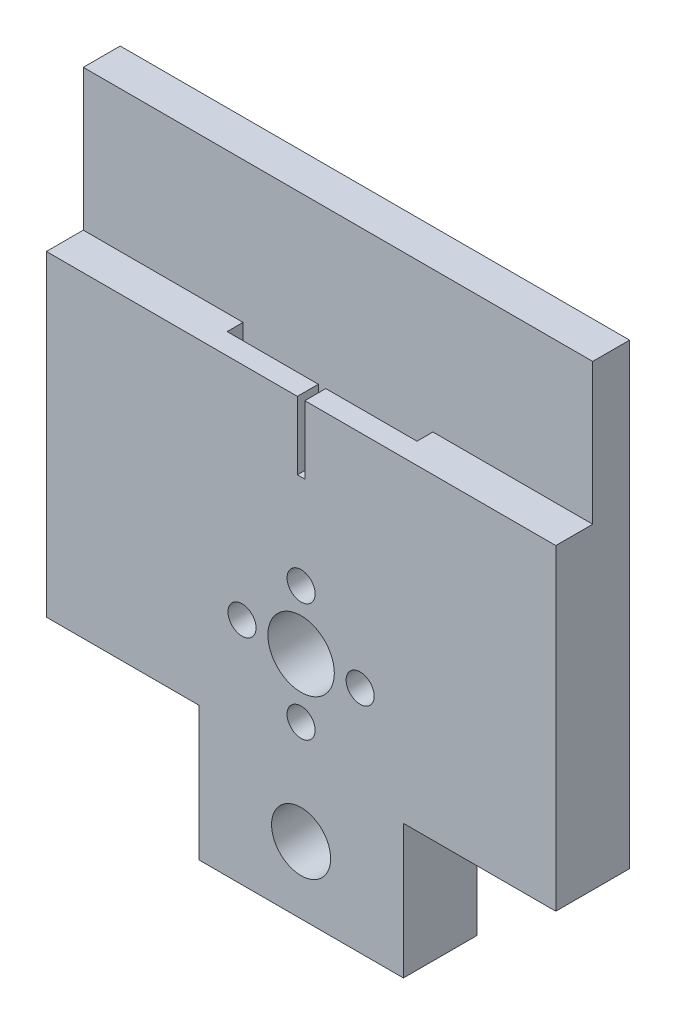
ISO-10303-21;
HEADER;
FILE_DESCRIPTION(('STEP AP214'),'2;1');
FILE_NAME('part.step','',(''),(''),'','','');
FILE_SCHEMA(('AUTOMOTIVE_DESIGN { 1 0 10303 214 1 1 1 1 }'));
ENDSEC;
DATA;
#1=APPLICATION_CONTEXT('core data for automotive mechanical design processes');
#2=APPLICATION_PROTOCOL_DEFINITION('international standard','automotive_design',2000,#1);
#3=PRODUCT_CONTEXT('',#1,'mechanical');
#4=PRODUCT('Part','Part','',(#3));
#5=PRODUCT_RELATED_PRODUCT_CATEGORY('part','',(#4));
#6=PRODUCT_DEFINITION_FORMATION('','',#4);
#7=PRODUCT_DEFINITION_CONTEXT('part definition',#1,'design');
#8=PRODUCT_DEFINITION('design','',#6,#7);
#9=PRODUCT_DEFINITION_SHAPE('','',#8);
#10=(LENGTH_UNIT() NAMED_UNIT(*) SI_UNIT(.MILLI.,.METRE.));
#11=(NAMED_UNIT(*) PLANE_ANGLE_UNIT() SI_UNIT($,.RADIAN.));
#12=(NAMED_UNIT(*) SI_UNIT($,.STERADIAN.) SOLID_ANGLE_UNIT());
#13=UNCERTAINTY_MEASURE_WITH_UNIT(LENGTH_MEASURE(1.E-05),#10,'distance_accuracy_value','');
#14=(GEOMETRIC_REPRESENTATION_CONTEXT(3) GLOBAL_UNCERTAINTY_ASSIGNED_CONTEXT((#13)) GLOBAL_UNIT_ASSIGNED_CONTEXT((#10,
#11,#12)) REPRESENTATION_CONTEXT('',''));
#15=CARTESIAN_POINT('',(0.,0.,0.));
#16=DIRECTION('',(0.,0.,1.));
#17=DIRECTION('',(1.,0.,0.));
#18=AXIS2_PLACEMENT_3D('',#15,#16,#17);
#19=CARTESIAN_POINT('',(-253.536671068928,20.97390674954,5.));
#20=DIRECTION('',(0.,1.,0.));
#21=DIRECTION('',(-1.,0.,0.));
#22=AXIS2_PLACEMENT_3D('',#19,#20,#21);
#23=PLANE('',#22);
#24=DIRECTION('',(0.,0.,-1.));
#25=VECTOR('',#24,1.);
#26=CARTESIAN_POINT('',(12.858,20.97390674954,5.));
#27=LINE('',#26,#25);
#28=CARTESIAN_POINT('',(12.858,20.97390674954,7.159));
#29=VERTEX_POINT('',#28);
#30=CARTESIAN_POINT('',(12.858,20.97390674954,5.));
#31=VERTEX_POINT('',#30);
#32=EDGE_CURVE('E219',#29,#31,#27,.T.);
#33=ORIENTED_EDGE('',*,*,#32,.F.);
#34=DIRECTION('',(1.,0.,0.));
#35=VECTOR('',#34,1.);
#36=CARTESIAN_POINT('',(12.858,20.97390674954,7.159));
#37=LINE('',#36,#35);
#38=CARTESIAN_POINT('',(0.507999999999997,20.97390674954,7.159));
#39=VERTEX_POINT('',#38);
#40=EDGE_CURVE('E223',#39,#29,#37,.T.);
#41=ORIENTED_EDGE('',*,*,#40,.F.);
#42=DIRECTION('',(0.,0.,1.));
#43=VECTOR('',#42,1.);
#44=CARTESIAN_POINT('',(0.508,20.97390674954,5.));
#45=LINE('',#44,#43);
#46=CARTESIAN_POINT('',(0.508,20.97390674954,10.));
#47=VERTEX_POINT('',#46);
#48=EDGE_CURVE('E291',#39,#47,#45,.T.);
#49=ORIENTED_EDGE('',*,*,#48,.T.);
#50=DIRECTION('',(1.,0.,0.));
#51=VECTOR('',#50,1.);
#52=CARTESIAN_POINT('',(-253.536671068928,20.97390674954,10.));
#53=LINE('',#52,#51);
#54=CARTESIAN_POINT('',(34.5,20.97390674954,10.));
#55=VERTEX_POINT('',#54);
#56=EDGE_CURVE('E310',#47,#55,#53,.T.);
#57=ORIENTED_EDGE('',*,*,#56,.T.);
#58=DIRECTION('',(0.,0.,-1.));
#59=VECTOR('',#58,1.);
#60=CARTESIAN_POINT('',(34.5,20.97390674954,10.));
#61=LINE('',#60,#59);
#62=CARTESIAN_POINT('',(34.5,20.97390674954,5.));
#63=VERTEX_POINT('',#62);
#64=EDGE_CURVE('E317',#55,#63,#61,.T.);
#65=ORIENTED_EDGE('',*,*,#64,.T.);
#66=DIRECTION('',(1.,0.,0.));
#67=VECTOR('',#66,1.);
#68=CARTESIAN_POINT('',(-253.536671068928,20.97390674954,5.));
#69=LINE('',#68,#67);
#70=EDGE_CURVE('E70',#31,#63,#69,.T.);
#71=ORIENTED_EDGE('',*,*,#70,.F.);
#72=EDGE_LOOP('',(#33,#41,#49,#57,#65,#71));
#73=FACE_BOUND('',#72,.T.);
#74=ADVANCED_FACE('F47',(#73),#23,.T.);
#75=CARTESIAN_POINT('',(34.5,40.07390674954,10.));
#76=DIRECTION('',(-1.,0.,0.));
#77=DIRECTION('',(0.,-1.,0.));
#78=AXIS2_PLACEMENT_3D('',#75,#76,#77);
#79=PLANE('',#78);
#80=DIRECTION('',(0.,1.,0.));
#81=VECTOR('',#80,1.);
#82=CARTESIAN_POINT('',(34.5,40.07390674954,5.));
#83=LINE('',#82,#81);
#84=CARTESIAN_POINT('',(34.5,40.07390674954,5.));
#85=VERTEX_POINT('',#84);
#86=EDGE_CURVE('E321',#63,#85,#83,.T.);
#87=ORIENTED_EDGE('',*,*,#86,.F.);
#88=ORIENTED_EDGE('',*,*,#64,.F.);
#89=DIRECTION('',(0.,1.,0.));
#90=VECTOR('',#89,1.);
#91=CARTESIAN_POINT('',(34.5,40.07390674954,10.));
#92=LINE('',#91,#90);
#93=CARTESIAN_POINT('',(34.5,-21.92609325046,10.));
#94=VERTEX_POINT('',#93);
#95=EDGE_CURVE('E377',#94,#55,#92,.T.);
#96=ORIENTED_EDGE('',*,*,#95,.F.);
#97=DIRECTION('',(0.,0.,-1.));
#98=VECTOR('',#97,1.);
#99=CARTESIAN_POINT('',(34.5,-21.92609325046,10.));
#100=LINE('',#99,#98);
#101=CARTESIAN_POINT('',(34.5,-21.92609325046,0.));
#102=VERTEX_POINT('',#101);
#103=EDGE_CURVE('E448',#94,#102,#100,.T.);
#104=ORIENTED_EDGE('',*,*,#103,.T.);
#105=DIRECTION('',(0.,1.,0.));
#106=VECTOR('',#105,1.);
#107=CARTESIAN_POINT('',(34.5,40.07390674954,0.));
#108=LINE('',#107,#106);
#109=CARTESIAN_POINT('',(34.5,40.07390674954,0.));
#110=VERTEX_POINT('',#109);
#111=EDGE_CURVE('E401',#102,#110,#108,.T.);
#112=ORIENTED_EDGE('',*,*,#111,.T.);
#113=DIRECTION('',(0.,0.,-1.));
#114=VECTOR('',#113,1.);
#115=CARTESIAN_POINT('',(34.5,40.07390674954,10.));
#116=LINE('',#115,#114);
#117=EDGE_CURVE('E445',#85,#110,#116,.T.);
#118=ORIENTED_EDGE('',*,*,#117,.F.);
#119=EDGE_LOOP('',(#87,#88,#96,#104,#112,#118));
#120=FACE_BOUND('',#119,.T.);
#121=ADVANCED_FACE('F498',(#120),#79,.F.);
#122=CARTESIAN_POINT('',(-34.5,40.07390674954,10.));
#123=DIRECTION('',(1.,0.,0.));
#124=DIRECTION('',(0.,1.,0.));
#125=AXIS2_PLACEMENT_3D('',#122,#123,#124);
#126=PLANE('',#125);
#127=DIRECTION('',(0.,-1.,0.));
#128=VECTOR('',#127,1.);
#129=CARTESIAN_POINT('',(-34.5,40.07390674954,5.));
#130=LINE('',#129,#128);
#131=CARTESIAN_POINT('',(-34.5,40.07390674954,5.));
#132=VERTEX_POINT('',#131);
#133=CARTESIAN_POINT('',(-34.5,20.97390674954,5.));
#134=VERTEX_POINT('',#133);
#135=EDGE_CURVE('E56',#132,#134,#130,.T.);
#136=ORIENTED_EDGE('',*,*,#135,.F.);
#137=DIRECTION('',(0.,0.,-1.));
#138=VECTOR('',#137,1.);
#139=CARTESIAN_POINT('',(-34.5,40.07390674954,10.));
#140=LINE('',#139,#138);
#141=CARTESIAN_POINT('',(-34.5,40.07390674954,0.));
#142=VERTEX_POINT('',#141);
#143=EDGE_CURVE('E442',#132,#142,#140,.T.);
#144=ORIENTED_EDGE('',*,*,#143,.T.);
#145=DIRECTION('',(0.,-1.,0.));
#146=VECTOR('',#145,1.);
#147=CARTESIAN_POINT('',(-34.5,40.07390674954,0.));
#148=LINE('',#147,#146);
#149=CARTESIAN_POINT('',(-34.5,-21.92609325046,0.));
#150=VERTEX_POINT('',#149);
#151=EDGE_CURVE('E409',#142,#150,#148,.T.);
#152=ORIENTED_EDGE('',*,*,#151,.T.);
#153=DIRECTION('',(0.,0.,-1.));
#154=VECTOR('',#153,1.);
#155=CARTESIAN_POINT('',(-34.5,-21.92609325046,10.));
#156=LINE('',#155,#154);
#157=CARTESIAN_POINT('',(-34.5,-21.92609325046,10.));
#158=VERTEX_POINT('',#157);
#159=EDGE_CURVE('E438',#158,#150,#156,.T.);
#160=ORIENTED_EDGE('',*,*,#159,.F.);
#161=DIRECTION('',(0.,-1.,0.));
#162=VECTOR('',#161,1.);
#163=CARTESIAN_POINT('',(-34.5,40.07390674954,10.));
#164=LINE('',#163,#162);
#165=CARTESIAN_POINT('',(-34.5000000000001,20.97390674954,10.));
#166=VERTEX_POINT('',#165);
#167=EDGE_CURVE('E382',#166,#158,#164,.T.);
#168=ORIENTED_EDGE('',*,*,#167,.F.);
#169=DIRECTION('',(0.,0.,1.));
#170=VECTOR('',#169,1.);
#171=CARTESIAN_POINT('',(-34.5,20.97390674954,10.));
#172=LINE('',#171,#170);
#173=EDGE_CURVE('E452',#134,#166,#172,.T.);
#174=ORIENTED_EDGE('',*,*,#173,.F.);
#175=EDGE_LOOP('',(#136,#144,#152,#160,#168,#174));
#176=FACE_BOUND('',#175,.T.);
#177=ADVANCED_FACE('F515',(#176),#126,.F.);
#178=CARTESIAN_POINT('',(34.5,-21.92609325046,10.));
#179=DIRECTION('',(0.,1.,0.));
#180=DIRECTION('',(-1.,0.,0.));
#181=AXIS2_PLACEMENT_3D('',#178,#179,#180);
#182=PLANE('',#181);
#183=DIRECTION('',(1.,0.,0.));
#184=VECTOR('',#183,1.);
#185=CARTESIAN_POINT('',(34.5,-21.92609325046,0.));
#186=LINE('',#185,#184);
#187=CARTESIAN_POINT('',(13.8610888215337,-21.92609325046,0.));
#188=VERTEX_POINT('',#187);
#189=EDGE_CURVE('E329',#188,#102,#186,.T.);
#190=ORIENTED_EDGE('',*,*,#189,.T.);
#191=ORIENTED_EDGE('',*,*,#103,.F.);
#192=DIRECTION('',(1.,0.,0.));
#193=VECTOR('',#192,1.);
#194=CARTESIAN_POINT('',(34.5,-21.92609325046,10.));
#195=LINE('',#194,#193);
#196=CARTESIAN_POINT('',(13.8610888215337,-21.92609325046,10.));
#197=VERTEX_POINT('',#196);
#198=EDGE_CURVE('E373',#197,#94,#195,.T.);
#199=ORIENTED_EDGE('',*,*,#198,.F.);
#200=DIRECTION('',(0.,0.,-1.));
#201=VECTOR('',#200,1.);
#202=CARTESIAN_POINT('',(13.8610888215337,-21.92609325046,10.));
#203=LINE('',#202,#201);
#204=EDGE_CURVE('E397',#197,#188,#203,.T.);
#205=ORIENTED_EDGE('',*,*,#204,.T.);
#206=EDGE_LOOP('',(#190,#191,#199,#205));
#207=FACE_BOUND('',#206,.T.);
#208=ADVANCED_FACE('F49',(#207),#182,.F.);
#209=CARTESIAN_POINT('',(-34.5,40.07390674954,10.));
#210=DIRECTION('',(0.,-1.,0.));
#211=DIRECTION('',(0.,0.,-1.));
#212=AXIS2_PLACEMENT_3D('',#209,#210,#211);
#213=PLANE('',#212);
#214=ORIENTED_EDGE('',*,*,#143,.F.);
#215=DIRECTION('',(1.,0.,0.));
#216=VECTOR('',#215,1.);
#217=CARTESIAN_POINT('',(-253.536671068928,40.07390674954,5.));
#218=LINE('',#217,#216);
#219=EDGE_CURVE('E309',#132,#85,#218,.T.);
#220=ORIENTED_EDGE('',*,*,#219,.T.);
#221=ORIENTED_EDGE('',*,*,#117,.T.);
#222=DIRECTION('',(-1.,0.,0.));
#223=VECTOR('',#222,1.);
#224=CARTESIAN_POINT('',(-34.5,40.07390674954,0.));
#225=LINE('',#224,#223);
#226=EDGE_CURVE('E405',#110,#142,#225,.T.);
#227=ORIENTED_EDGE('',*,*,#226,.T.);
#228=EDGE_LOOP('',(#214,#220,#221,#227));
#229=FACE_BOUND('',#228,.T.);
#230=ADVANCED_FACE('F514',(#229),#213,.F.);
#231=CARTESIAN_POINT('',(-34.5,-21.92609325046,10.));
#232=DIRECTION('',(0.,1.,0.));
#233=DIRECTION('',(-1.,0.,0.));
#234=AXIS2_PLACEMENT_3D('',#231,#232,#233);
#235=PLANE('',#234);
#236=DIRECTION('',(1.,0.,0.));
#237=VECTOR('',#236,1.);
#238=CARTESIAN_POINT('',(-34.5,-21.92609325046,0.));
#239=LINE('',#238,#237);
#240=CARTESIAN_POINT('',(-13.8610888215337,-21.92609325046,0.));
#241=VERTEX_POINT('',#240);
#242=EDGE_CURVE('E412',#150,#241,#239,.T.);
#243=ORIENTED_EDGE('',*,*,#242,.T.);
#244=DIRECTION('',(0.,0.,-1.));
#245=VECTOR('',#244,1.);
#246=CARTESIAN_POINT('',(-13.8610888215337,-21.92609325046,10.));
#247=LINE('',#246,#245);
#248=CARTESIAN_POINT('',(-13.8610888215337,-21.92609325046,10.));
#249=VERTEX_POINT('',#248);
#250=EDGE_CURVE('E434',#249,#241,#247,.T.);
#251=ORIENTED_EDGE('',*,*,#250,.F.);
#252=DIRECTION('',(1.,0.,0.));
#253=VECTOR('',#252,1.);
#254=CARTESIAN_POINT('',(-34.5,-21.92609325046,10.));
#255=LINE('',#254,#253);
#256=EDGE_CURVE('E385',#158,#249,#255,.T.);
#257=ORIENTED_EDGE('',*,*,#256,.F.);
#258=ORIENTED_EDGE('',*,*,#159,.T.);
#259=EDGE_LOOP('',(#243,#251,#257,#258));
#260=FACE_BOUND('',#259,.T.);
#261=ADVANCED_FACE('F519',(#260),#235,.F.);
#262=CARTESIAN_POINT('',(-13.8610888215337,-21.92609325046,10.));
#263=DIRECTION('',(1.,0.,0.));
#264=DIRECTION('',(0.,1.,0.));
#265=AXIS2_PLACEMENT_3D('',#262,#263,#264);
#266=PLANE('',#265);
#267=DIRECTION('',(0.,-1.,0.));
#268=VECTOR('',#267,1.);
#269=CARTESIAN_POINT('',(-13.8610888215337,-21.92609325046,0.));
#270=LINE('',#269,#268);
#271=CARTESIAN_POINT('',(-13.8610888215337,-40.07390674954,0.));
#272=VERTEX_POINT('',#271);
#273=EDGE_CURVE('E415',#241,#272,#270,.T.);
#274=ORIENTED_EDGE('',*,*,#273,.T.);
#275=DIRECTION('',(0.,0.,-1.));
#276=VECTOR('',#275,1.);
#277=CARTESIAN_POINT('',(-13.8610888215337,-40.07390674954,10.));
#278=LINE('',#277,#276);
#279=CARTESIAN_POINT('',(-13.8610888215337,-40.07390674954,10.));
#280=VERTEX_POINT('',#279);
#281=EDGE_CURVE('E430',#280,#272,#278,.T.);
#282=ORIENTED_EDGE('',*,*,#281,.F.);
#283=DIRECTION('',(0.,-1.,0.));
#284=VECTOR('',#283,1.);
#285=CARTESIAN_POINT('',(-13.8610888215337,-21.92609325046,10.));
#286=LINE('',#285,#284);
#287=EDGE_CURVE('E388',#249,#280,#286,.T.);
#288=ORIENTED_EDGE('',*,*,#287,.F.);
#289=ORIENTED_EDGE('',*,*,#250,.T.);
#290=EDGE_LOOP('',(#274,#282,#288,#289));
#291=FACE_BOUND('',#290,.T.);
#292=ADVANCED_FACE('F526',(#291),#266,.F.);
#293=CARTESIAN_POINT('',(13.8610888215337,-40.07390674954,10.));
#294=DIRECTION('',(0.,1.,0.));
#295=DIRECTION('',(0.,0.,1.));
#296=AXIS2_PLACEMENT_3D('',#293,#294,#295);
#297=PLANE('',#296);
#298=DIRECTION('',(1.,0.,0.));
#299=VECTOR('',#298,1.);
#300=CARTESIAN_POINT('',(13.8610888215337,-40.07390674954,0.));
#301=LINE('',#300,#299);
#302=CARTESIAN_POINT('',(13.8610888215337,-40.07390674954,0.));
#303=VERTEX_POINT('',#302);
#304=EDGE_CURVE('E418',#272,#303,#301,.T.);
#305=ORIENTED_EDGE('',*,*,#304,.T.);
#306=DIRECTION('',(0.,0.,-1.));
#307=VECTOR('',#306,1.);
#308=CARTESIAN_POINT('',(13.8610888215337,-40.07390674954,10.));
#309=LINE('',#308,#307);
#310=CARTESIAN_POINT('',(13.8610888215337,-40.07390674954,10.));
#311=VERTEX_POINT('',#310);
#312=EDGE_CURVE('E426',#311,#303,#309,.T.);
#313=ORIENTED_EDGE('',*,*,#312,.F.);
#314=DIRECTION('',(1.,0.,0.));
#315=VECTOR('',#314,1.);
#316=CARTESIAN_POINT('',(13.8610888215337,-40.07390674954,10.));
#317=LINE('',#316,#315);
#318=EDGE_CURVE('E391',#280,#311,#317,.T.);
#319=ORIENTED_EDGE('',*,*,#318,.F.);
#320=ORIENTED_EDGE('',*,*,#281,.T.);
#321=EDGE_LOOP('',(#305,#313,#319,#320));
#322=FACE_BOUND('',#321,.T.);
#323=ADVANCED_FACE('F530',(#322),#297,.F.);
#324=CARTESIAN_POINT('',(13.8610888215337,-21.92609325046,10.));
#325=DIRECTION('',(-1.,0.,0.));
#326=DIRECTION('',(0.,-1.,0.));
#327=AXIS2_PLACEMENT_3D('',#324,#325,#326);
#328=PLANE('',#327);
#329=DIRECTION('',(0.,1.,0.));
#330=VECTOR('',#329,1.);
#331=CARTESIAN_POINT('',(13.8610888215337,-21.92609325046,0.));
#332=LINE('',#331,#330);
#333=EDGE_CURVE('E378',#303,#188,#332,.T.);
#334=ORIENTED_EDGE('',*,*,#333,.T.);
#335=ORIENTED_EDGE('',*,*,#204,.F.);
#336=DIRECTION('',(0.,1.,0.));
#337=VECTOR('',#336,1.);
#338=CARTESIAN_POINT('',(13.8610888215337,-21.92609325046,10.));
#339=LINE('',#338,#337);
#340=EDGE_CURVE('E394',#311,#197,#339,.T.);
#341=ORIENTED_EDGE('',*,*,#340,.F.);
#342=ORIENTED_EDGE('',*,*,#312,.T.);
#343=EDGE_LOOP('',(#334,#335,#341,#342));
#344=FACE_BOUND('',#343,.T.);
#345=ADVANCED_FACE('F590',(#344),#328,.F.);
#346=CARTESIAN_POINT('',(0.,0.,10.));
#347=DIRECTION('',(0.,0.,1.));
#348=DIRECTION('',(1.,0.,0.));
#349=AXIS2_PLACEMENT_3D('',#346,#347,#348);
#350=PLANE('',#349);
#351=DIRECTION('',(0.,1.,0.));
#352=VECTOR('',#351,1.);
#353=CARTESIAN_POINT('',(0.508,20.97390674954,10.));
#354=LINE('',#353,#352);
#355=CARTESIAN_POINT('',(0.508000000000001,11.76640674954,10.));
#356=VERTEX_POINT('',#355);
#357=EDGE_CURVE('E280',#356,#47,#354,.T.);
#358=ORIENTED_EDGE('',*,*,#357,.F.);
#359=DIRECTION('',(1.,0.,0.));
#360=VECTOR('',#359,1.);
#361=CARTESIAN_POINT('',(-0.507999999999999,11.76640674954,10.));
#362=LINE('',#361,#360);
#363=CARTESIAN_POINT('',(-0.507999999999999,11.76640674954,10.));
#364=VERTEX_POINT('',#363);
#365=EDGE_CURVE('E284',#364,#356,#362,.T.);
#366=ORIENTED_EDGE('',*,*,#365,.F.);
#367=DIRECTION('',(0.,-1.,0.));
#368=VECTOR('',#367,1.);
#369=CARTESIAN_POINT('',(-0.508,20.97390674954,10.));
#370=LINE('',#369,#368);
#371=CARTESIAN_POINT('',(-0.508,20.97390674954,10.));
#372=VERTEX_POINT('',#371);
#373=EDGE_CURVE('E267',#372,#364,#370,.T.);
#374=ORIENTED_EDGE('',*,*,#373,.F.);
#375=EDGE_CURVE('E305',#166,#372,#53,.T.);
#376=ORIENTED_EDGE('',*,*,#375,.F.);
#377=ORIENTED_EDGE('',*,*,#167,.T.);
#378=ORIENTED_EDGE('',*,*,#256,.T.);
#379=ORIENTED_EDGE('',*,*,#287,.T.);
#380=ORIENTED_EDGE('',*,*,#318,.T.);
#381=ORIENTED_EDGE('',*,*,#340,.T.);
#382=ORIENTED_EDGE('',*,*,#198,.T.);
#383=ORIENTED_EDGE('',*,*,#95,.T.);
#384=ORIENTED_EDGE('',*,*,#56,.F.);
#385=EDGE_LOOP('',(#358,#366,#374,#376,#377,#378,#379,#380,#381,#382,#383,#384));
#386=FACE_BOUND('',#385,.T.);
#387=CARTESIAN_POINT('',(0.,-31.,10.));
#388=DIRECTION('',(0.,0.,1.));
#389=DIRECTION('',(1.,0.,0.));
#390=AXIS2_PLACEMENT_3D('',#387,#388,#389);
#391=CIRCLE('',#390,4.);
#392=CARTESIAN_POINT('',(4.,-31.,10.));
#393=VERTEX_POINT('',#392);
#394=EDGE_CURVE('E330',#393,#393,#391,.T.);
#395=ORIENTED_EDGE('',*,*,#394,.F.);
#396=EDGE_LOOP('',(#395));
#397=FACE_BOUND('',#396,.T.);
#398=CARTESIAN_POINT('',(1.34766330039948E-13,-16.9999999999999,10.));
#399=DIRECTION('',(0.,0.,1.));
#400=DIRECTION('',(1.,0.,0.));
#401=AXIS2_PLACEMENT_3D('',#398,#399,#400);
#402=CIRCLE('',#401,1.9);
#403=CARTESIAN_POINT('',(1.90000000000013,-16.9999999999999,10.));
#404=VERTEX_POINT('',#403);
#405=EDGE_CURVE('E344',#404,#404,#402,.T.);
#406=ORIENTED_EDGE('',*,*,#405,.F.);
#407=EDGE_LOOP('',(#406));
#408=FACE_BOUND('',#407,.T.);
#409=CARTESIAN_POINT('',(8.00000000000003,-8.9999999999999,10.));
#410=DIRECTION('',(0.,0.,1.));
#411=DIRECTION('',(1.,0.,0.));
#412=AXIS2_PLACEMENT_3D('',#409,#410,#411);
#413=CIRCLE('',#412,1.9);
#414=CARTESIAN_POINT('',(9.90000000000003,-8.9999999999999,10.));
#415=VERTEX_POINT('',#414);
#416=EDGE_CURVE('E335',#415,#415,#413,.T.);
#417=ORIENTED_EDGE('',*,*,#416,.F.);
#418=EDGE_LOOP('',(#417));
#419=FACE_BOUND('',#418,.T.);
#420=CARTESIAN_POINT('',(0.,-9.,10.));
#421=DIRECTION('',(0.,0.,1.));
#422=DIRECTION('',(1.,0.,0.));
#423=AXIS2_PLACEMENT_3D('',#420,#421,#422);
#424=CIRCLE('',#423,4.5);
#425=CARTESIAN_POINT('',(4.5,-9.,10.));
#426=VERTEX_POINT('',#425);
#427=EDGE_CURVE('E360',#426,#426,#424,.T.);
#428=ORIENTED_EDGE('',*,*,#427,.F.);
#429=EDGE_LOOP('',(#428));
#430=FACE_BOUND('',#429,.T.);
#431=CARTESIAN_POINT('',(0.,-1.,10.));
#432=DIRECTION('',(0.,0.,1.));
#433=DIRECTION('',(1.,0.,0.));
#434=AXIS2_PLACEMENT_3D('',#431,#432,#433);
#435=CIRCLE('',#434,1.9);
#436=CARTESIAN_POINT('',(1.90000000000001,-1.,10.));
#437=VERTEX_POINT('',#436);
#438=EDGE_CURVE('E334',#437,#437,#435,.T.);
#439=ORIENTED_EDGE('',*,*,#438,.F.);
#440=EDGE_LOOP('',(#439));
#441=FACE_BOUND('',#440,.T.);
#442=CARTESIAN_POINT('',(-7.99999999999989,-9.00000000000002,10.));
#443=DIRECTION('',(0.,0.,1.));
#444=DIRECTION('',(1.,0.,0.));
#445=AXIS2_PLACEMENT_3D('',#442,#443,#444);
#446=CIRCLE('',#445,1.9);
#447=CARTESIAN_POINT('',(-6.09999999999989,-9.00000000000002,10.));
#448=VERTEX_POINT('',#447);
#449=EDGE_CURVE('E352',#448,#448,#446,.T.);
#450=ORIENTED_EDGE('',*,*,#449,.F.);
#451=EDGE_LOOP('',(#450));
#452=FACE_BOUND('',#451,.T.);
#453=ADVANCED_FACE('F500',(#386,#397,#408,#419,#430,#441,#452),#350,.T.);
#454=CARTESIAN_POINT('',(0.,0.,0.));
#455=DIRECTION('',(0.,0.,1.));
#456=DIRECTION('',(1.,0.,0.));
#457=AXIS2_PLACEMENT_3D('',#454,#455,#456);
#458=PLANE('',#457);
#459=CARTESIAN_POINT('',(0.,-31.,0.));
#460=DIRECTION('',(0.,0.,1.));
#461=DIRECTION('',(1.,0.,0.));
#462=AXIS2_PLACEMENT_3D('',#459,#460,#461);
#463=CIRCLE('',#462,4.);
#464=CARTESIAN_POINT('',(4.,-31.,0.));
#465=VERTEX_POINT('',#464);
#466=EDGE_CURVE('E325',#465,#465,#463,.T.);
#467=ORIENTED_EDGE('',*,*,#466,.T.);
#468=EDGE_LOOP('',(#467));
#469=FACE_BOUND('',#468,.T.);
#470=CARTESIAN_POINT('',(1.34766330039948E-13,-16.9999999999999,0.));
#471=DIRECTION('',(0.,0.,1.));
#472=DIRECTION('',(1.,0.,0.));
#473=AXIS2_PLACEMENT_3D('',#470,#471,#472);
#474=CIRCLE('',#473,1.9);
#475=CARTESIAN_POINT('',(1.90000000000013,-16.9999999999999,0.));
#476=VERTEX_POINT('',#475);
#477=EDGE_CURVE('E348',#476,#476,#474,.T.);
#478=ORIENTED_EDGE('',*,*,#477,.T.);
#479=EDGE_LOOP('',(#478));
#480=FACE_BOUND('',#479,.T.);
#481=CARTESIAN_POINT('',(8.00000000000003,-8.9999999999999,0.));
#482=DIRECTION('',(0.,0.,1.));
#483=DIRECTION('',(1.,0.,0.));
#484=AXIS2_PLACEMENT_3D('',#481,#482,#483);
#485=CIRCLE('',#484,1.9);
#486=CARTESIAN_POINT('',(9.90000000000003,-8.9999999999999,0.));
#487=VERTEX_POINT('',#486);
#488=EDGE_CURVE('E340',#487,#487,#485,.T.);
#489=ORIENTED_EDGE('',*,*,#488,.T.);
#490=EDGE_LOOP('',(#489));
#491=FACE_BOUND('',#490,.T.);
#492=CARTESIAN_POINT('',(0.,-9.,0.));
#493=DIRECTION('',(0.,0.,1.));
#494=DIRECTION('',(1.,0.,0.));
#495=AXIS2_PLACEMENT_3D('',#492,#493,#494);
#496=CIRCLE('',#495,4.5);
#497=CARTESIAN_POINT('',(4.5,-9.,0.));
#498=VERTEX_POINT('',#497);
#499=EDGE_CURVE('E339',#498,#498,#496,.T.);
#500=ORIENTED_EDGE('',*,*,#499,.T.);
#501=EDGE_LOOP('',(#500));
#502=FACE_BOUND('',#501,.T.);
#503=CARTESIAN_POINT('',(0.,-1.,0.));
#504=DIRECTION('',(0.,0.,1.));
#505=DIRECTION('',(1.,0.,0.));
#506=AXIS2_PLACEMENT_3D('',#503,#504,#505);
#507=CIRCLE('',#506,1.9);
#508=CARTESIAN_POINT('',(1.90000000000001,-1.,0.));
#509=VERTEX_POINT('',#508);
#510=EDGE_CURVE('E356',#509,#509,#507,.T.);
#511=ORIENTED_EDGE('',*,*,#510,.T.);
#512=EDGE_LOOP('',(#511));
#513=FACE_BOUND('',#512,.T.);
#514=CARTESIAN_POINT('',(-7.99999999999989,-9.00000000000002,0.));
#515=DIRECTION('',(0.,0.,1.));
#516=DIRECTION('',(1.,0.,0.));
#517=AXIS2_PLACEMENT_3D('',#514,#515,#516);
#518=CIRCLE('',#517,1.9);
#519=CARTESIAN_POINT('',(-6.09999999999989,-9.00000000000002,0.));
#520=VERTEX_POINT('',#519);
#521=EDGE_CURVE('E324',#520,#520,#518,.T.);
#522=ORIENTED_EDGE('',*,*,#521,.T.);
#523=EDGE_LOOP('',(#522));
#524=FACE_BOUND('',#523,.T.);
#525=ORIENTED_EDGE('',*,*,#189,.F.);
#526=ORIENTED_EDGE('',*,*,#333,.F.);
#527=ORIENTED_EDGE('',*,*,#304,.F.);
#528=ORIENTED_EDGE('',*,*,#273,.F.);
#529=ORIENTED_EDGE('',*,*,#242,.F.);
#530=ORIENTED_EDGE('',*,*,#151,.F.);
#531=ORIENTED_EDGE('',*,*,#226,.F.);
#532=ORIENTED_EDGE('',*,*,#111,.F.);
#533=EDGE_LOOP('',(#525,#526,#527,#528,#529,#530,#531,#532));
#534=FACE_BOUND('',#533,.T.);
#535=ADVANCED_FACE('F511',(#469,#480,#491,#502,#513,#524,#534),#458,.F.);
#536=CARTESIAN_POINT('',(-7.99999999999989,-9.00000000000002,0.));
#537=DIRECTION('',(0.,0.,1.));
#538=DIRECTION('',(1.,0.,0.));
#539=AXIS2_PLACEMENT_3D('',#536,#537,#538);
#540=CYLINDRICAL_SURFACE('',#539,1.9);
#541=ORIENTED_EDGE('',*,*,#521,.F.);
#542=EDGE_LOOP('',(#541));
#543=FACE_BOUND('',#542,.T.);
#544=ORIENTED_EDGE('',*,*,#449,.T.);
#545=EDGE_LOOP('',(#544));
#546=FACE_BOUND('',#545,.T.);
#547=ADVANCED_FACE('F581',(#543,#546),#540,.F.);
#548=CARTESIAN_POINT('',(0.,-1.,0.));
#549=DIRECTION('',(0.,0.,1.));
#550=DIRECTION('',(1.,0.,0.));
#551=AXIS2_PLACEMENT_3D('',#548,#549,#550);
#552=CYLINDRICAL_SURFACE('',#551,1.9);
#553=ORIENTED_EDGE('',*,*,#510,.F.);
#554=EDGE_LOOP('',(#553));
#555=FACE_BOUND('',#554,.T.);
#556=ORIENTED_EDGE('',*,*,#438,.T.);
#557=EDGE_LOOP('',(#556));
#558=FACE_BOUND('',#557,.T.);
#559=ADVANCED_FACE('F578',(#555,#558),#552,.F.);
#560=CARTESIAN_POINT('',(0.,-9.,0.));
#561=DIRECTION('',(0.,0.,1.));
#562=DIRECTION('',(1.,0.,0.));
#563=AXIS2_PLACEMENT_3D('',#560,#561,#562);
#564=CYLINDRICAL_SURFACE('',#563,4.5);
#565=ORIENTED_EDGE('',*,*,#499,.F.);
#566=EDGE_LOOP('',(#565));
#567=FACE_BOUND('',#566,.T.);
#568=ORIENTED_EDGE('',*,*,#427,.T.);
#569=EDGE_LOOP('',(#568));
#570=FACE_BOUND('',#569,.T.);
#571=ADVANCED_FACE('F573',(#567,#570),#564,.F.);
#572=CARTESIAN_POINT('',(8.00000000000003,-8.9999999999999,0.));
#573=DIRECTION('',(0.,0.,1.));
#574=DIRECTION('',(1.,0.,0.));
#575=AXIS2_PLACEMENT_3D('',#572,#573,#574);
#576=CYLINDRICAL_SURFACE('',#575,1.9);
#577=ORIENTED_EDGE('',*,*,#488,.F.);
#578=EDGE_LOOP('',(#577));
#579=FACE_BOUND('',#578,.T.);
#580=ORIENTED_EDGE('',*,*,#416,.T.);
#581=EDGE_LOOP('',(#580));
#582=FACE_BOUND('',#581,.T.);
#583=ADVANCED_FACE('F570',(#579,#582),#576,.F.);
#584=CARTESIAN_POINT('',(1.34766330039948E-13,-16.9999999999999,0.));
#585=DIRECTION('',(0.,0.,1.));
#586=DIRECTION('',(1.,0.,0.));
#587=AXIS2_PLACEMENT_3D('',#584,#585,#586);
#588=CYLINDRICAL_SURFACE('',#587,1.9);
#589=ORIENTED_EDGE('',*,*,#477,.F.);
#590=EDGE_LOOP('',(#589));
#591=FACE_BOUND('',#590,.T.);
#592=ORIENTED_EDGE('',*,*,#405,.T.);
#593=EDGE_LOOP('',(#592));
#594=FACE_BOUND('',#593,.T.);
#595=ADVANCED_FACE('F566',(#591,#594),#588,.F.);
#596=CARTESIAN_POINT('',(0.,-31.,0.));
#597=DIRECTION('',(0.,0.,1.));
#598=DIRECTION('',(1.,0.,0.));
#599=AXIS2_PLACEMENT_3D('',#596,#597,#598);
#600=CYLINDRICAL_SURFACE('',#599,4.);
#601=ORIENTED_EDGE('',*,*,#466,.F.);
#602=EDGE_LOOP('',(#601));
#603=FACE_BOUND('',#602,.T.);
#604=ORIENTED_EDGE('',*,*,#394,.T.);
#605=EDGE_LOOP('',(#604));
#606=FACE_BOUND('',#605,.T.);
#607=ADVANCED_FACE('F562',(#603,#606),#600,.F.);
#608=CARTESIAN_POINT('',(-253.536671068928,40.07390674954,5.));
#609=DIRECTION('',(0.,0.,1.));
#610=DIRECTION('',(0.,-1.,0.));
#611=AXIS2_PLACEMENT_3D('',#608,#609,#610);
#612=PLANE('',#611);
#613=DIRECTION('',(0.,1.,0.));
#614=VECTOR('',#613,1.);
#615=CARTESIAN_POINT('',(12.858,11.01990674954,5.));
#616=LINE('',#615,#614);
#617=CARTESIAN_POINT('',(12.858,11.01990674954,5.));
#618=VERTEX_POINT('',#617);
#619=EDGE_CURVE('E233',#618,#31,#616,.T.);
#620=ORIENTED_EDGE('',*,*,#619,.T.);
#621=ORIENTED_EDGE('',*,*,#70,.T.);
#622=ORIENTED_EDGE('',*,*,#86,.T.);
#623=ORIENTED_EDGE('',*,*,#219,.F.);
#624=ORIENTED_EDGE('',*,*,#135,.T.);
#625=CARTESIAN_POINT('',(-12.858,20.97390674954,5.));
#626=VERTEX_POINT('',#625);
#627=EDGE_CURVE('E311',#134,#626,#69,.T.);
#628=ORIENTED_EDGE('',*,*,#627,.T.);
#629=DIRECTION('',(0.,1.,0.));
#630=VECTOR('',#629,1.);
#631=CARTESIAN_POINT('',(-12.858,11.01990674954,5.));
#632=LINE('',#631,#630);
#633=CARTESIAN_POINT('',(-12.858,11.01990674954,5.));
#634=VERTEX_POINT('',#633);
#635=EDGE_CURVE('E258',#634,#626,#632,.T.);
#636=ORIENTED_EDGE('',*,*,#635,.F.);
#637=DIRECTION('',(-1.,0.,0.));
#638=VECTOR('',#637,1.);
#639=CARTESIAN_POINT('',(-12.858,11.01990674954,5.));
#640=LINE('',#639,#638);
#641=CARTESIAN_POINT('',(-0.507999999999999,11.01990674954,5.));
#642=VERTEX_POINT('',#641);
#643=EDGE_CURVE('E242',#642,#634,#640,.T.);
#644=ORIENTED_EDGE('',*,*,#643,.F.);
#645=DIRECTION('',(0.,1.,0.));
#646=VECTOR('',#645,1.);
#647=CARTESIAN_POINT('',(-0.507999999999999,11.01990674954,5.));
#648=LINE('',#647,#646);
#649=CARTESIAN_POINT('',(-0.508,11.76640674954,5.));
#650=VERTEX_POINT('',#649);
#651=EDGE_CURVE('E264',#642,#650,#648,.T.);
#652=ORIENTED_EDGE('',*,*,#651,.T.);
#653=DIRECTION('',(1.,0.,0.));
#654=VECTOR('',#653,1.);
#655=CARTESIAN_POINT('',(-0.507999999999999,11.76640674954,5.));
#656=LINE('',#655,#654);
#657=CARTESIAN_POINT('',(0.508000000000001,11.76640674954,5.));
#658=VERTEX_POINT('',#657);
#659=EDGE_CURVE('E198',#650,#658,#656,.T.);
#660=ORIENTED_EDGE('',*,*,#659,.T.);
#661=DIRECTION('',(0.,1.,0.));
#662=VECTOR('',#661,1.);
#663=CARTESIAN_POINT('',(0.507999999999998,11.01990674954,5.));
#664=LINE('',#663,#662);
#665=CARTESIAN_POINT('',(0.507999999999998,11.01990674954,5.));
#666=VERTEX_POINT('',#665);
#667=EDGE_CURVE('E190',#666,#658,#664,.T.);
#668=ORIENTED_EDGE('',*,*,#667,.F.);
#669=DIRECTION('',(-1.,0.,0.));
#670=VECTOR('',#669,1.);
#671=CARTESIAN_POINT('',(0.507999999999998,11.01990674954,5.));
#672=LINE('',#671,#670);
#673=EDGE_CURVE('E194',#618,#666,#672,.T.);
#674=ORIENTED_EDGE('',*,*,#673,.F.);
#675=EDGE_LOOP('',(#620,#621,#622,#623,#624,#628,#636,#644,#652,#660,#668,#674));
#676=FACE_BOUND('',#675,.T.);
#677=ADVANCED_FACE('F192',(#676),#612,.T.);
#678=DIRECTION('',(1.,0.,0.));
#679=VECTOR('',#678,1.);
#680=CARTESIAN_POINT('',(-12.858,20.97390674954,7.159));
#681=LINE('',#680,#679);
#682=CARTESIAN_POINT('',(-12.858,20.97390674954,7.159));
#683=VERTEX_POINT('',#682);
#684=CARTESIAN_POINT('',(-0.508,20.97390674954,7.159));
#685=VERTEX_POINT('',#684);
#686=EDGE_CURVE('E63',#683,#685,#681,.T.);
#687=ORIENTED_EDGE('',*,*,#686,.F.);
#688=DIRECTION('',(0.,0.,1.));
#689=VECTOR('',#688,1.);
#690=CARTESIAN_POINT('',(-12.858,20.97390674954,5.));
#691=LINE('',#690,#689);
#692=EDGE_CURVE('E236',#626,#683,#691,.T.);
#693=ORIENTED_EDGE('',*,*,#692,.F.);
#694=ORIENTED_EDGE('',*,*,#627,.F.);
#695=ORIENTED_EDGE('',*,*,#173,.T.);
#696=ORIENTED_EDGE('',*,*,#375,.T.);
#697=DIRECTION('',(0.,0.,1.));
#698=VECTOR('',#697,1.);
#699=CARTESIAN_POINT('',(-0.508,20.97390674954,5.));
#700=LINE('',#699,#698);
#701=EDGE_CURVE('E279',#685,#372,#700,.T.);
#702=ORIENTED_EDGE('',*,*,#701,.F.);
#703=EDGE_LOOP('',(#687,#693,#694,#695,#696,#702));
#704=FACE_BOUND('',#703,.T.);
#705=ADVANCED_FACE('F463',(#704),#23,.T.);
#706=CARTESIAN_POINT('',(0.508,20.97390674954,5.));
#707=DIRECTION('',(1.,0.,0.));
#708=DIRECTION('',(0.,1.,0.));
#709=AXIS2_PLACEMENT_3D('',#706,#707,#708);
#710=PLANE('',#709);
#711=ORIENTED_EDGE('',*,*,#48,.F.);
#712=DIRECTION('',(0.,1.,0.));
#713=VECTOR('',#712,1.);
#714=CARTESIAN_POINT('',(0.507999999999998,11.01990674954,7.159));
#715=LINE('',#714,#713);
#716=CARTESIAN_POINT('',(0.507999999999998,11.76640674954,7.159));
#717=VERTEX_POINT('',#716);
#718=EDGE_CURVE('E202',#717,#39,#715,.T.);
#719=ORIENTED_EDGE('',*,*,#718,.F.);
#720=DIRECTION('',(0.,0.,1.));
#721=VECTOR('',#720,1.);
#722=CARTESIAN_POINT('',(0.508000000000001,11.76640674954,5.));
#723=LINE('',#722,#721);
#724=EDGE_CURVE('E297',#717,#356,#723,.T.);
#725=ORIENTED_EDGE('',*,*,#724,.T.);
#726=ORIENTED_EDGE('',*,*,#357,.T.);
#727=EDGE_LOOP('',(#711,#719,#725,#726));
#728=FACE_BOUND('',#727,.T.);
#729=ADVANCED_FACE('F485',(#728),#710,.F.);
#730=CARTESIAN_POINT('',(-0.507999999999999,11.76640674954,5.));
#731=DIRECTION('',(0.,-1.,0.));
#732=DIRECTION('',(0.,0.,-1.));
#733=AXIS2_PLACEMENT_3D('',#730,#731,#732);
#734=PLANE('',#733);
#735=ORIENTED_EDGE('',*,*,#365,.T.);
#736=ORIENTED_EDGE('',*,*,#724,.F.);
#737=EDGE_CURVE('E294',#658,#717,#723,.T.);
#738=ORIENTED_EDGE('',*,*,#737,.F.);
#739=ORIENTED_EDGE('',*,*,#659,.F.);
#740=DIRECTION('',(0.,0.,1.));
#741=VECTOR('',#740,1.);
#742=CARTESIAN_POINT('',(-0.507999999999999,11.76640674954,5.));
#743=LINE('',#742,#741);
#744=CARTESIAN_POINT('',(-0.508,11.76640674954,7.159));
#745=VERTEX_POINT('',#744);
#746=EDGE_CURVE('E298',#650,#745,#743,.T.);
#747=ORIENTED_EDGE('',*,*,#746,.T.);
#748=EDGE_CURVE('E302',#745,#364,#743,.T.);
#749=ORIENTED_EDGE('',*,*,#748,.T.);
#750=EDGE_LOOP('',(#735,#736,#738,#739,#747,#749));
#751=FACE_BOUND('',#750,.T.);
#752=ADVANCED_FACE('F477',(#751),#734,.F.);
#753=CARTESIAN_POINT('',(-0.508,20.97390674954,5.));
#754=DIRECTION('',(-1.,0.,0.));
#755=DIRECTION('',(0.,-1.,0.));
#756=AXIS2_PLACEMENT_3D('',#753,#754,#755);
#757=PLANE('',#756);
#758=ORIENTED_EDGE('',*,*,#748,.F.);
#759=DIRECTION('',(0.,1.,0.));
#760=VECTOR('',#759,1.);
#761=CARTESIAN_POINT('',(-0.508,20.97390674954,7.159));
#762=LINE('',#761,#760);
#763=EDGE_CURVE('E11',#745,#685,#762,.T.);
#764=ORIENTED_EDGE('',*,*,#763,.T.);
#765=ORIENTED_EDGE('',*,*,#701,.T.);
#766=ORIENTED_EDGE('',*,*,#373,.T.);
#767=EDGE_LOOP('',(#758,#764,#765,#766));
#768=FACE_BOUND('',#767,.T.);
#769=ADVANCED_FACE('F536',(#768),#757,.F.);
#770=CARTESIAN_POINT('',(-0.507999999999999,11.01990674954,5.));
#771=DIRECTION('',(1.,0.,0.));
#772=DIRECTION('',(0.,1.,0.));
#773=AXIS2_PLACEMENT_3D('',#770,#771,#772);
#774=PLANE('',#773);
#775=ORIENTED_EDGE('',*,*,#651,.F.);
#776=DIRECTION('',(0.,0.,-1.));
#777=VECTOR('',#776,1.);
#778=CARTESIAN_POINT('',(-0.507999999999999,11.01990674954,5.));
#779=LINE('',#778,#777);
#780=CARTESIAN_POINT('',(-0.508,11.01990674954,7.159));
#781=VERTEX_POINT('',#780);
#782=EDGE_CURVE('E254',#781,#642,#779,.T.);
#783=ORIENTED_EDGE('',*,*,#782,.F.);
#784=DIRECTION('',(0.,1.,0.));
#785=VECTOR('',#784,1.);
#786=CARTESIAN_POINT('',(-0.508,11.01990674954,7.159));
#787=LINE('',#786,#785);
#788=EDGE_CURVE('E268',#781,#745,#787,.T.);
#789=ORIENTED_EDGE('',*,*,#788,.T.);
#790=ORIENTED_EDGE('',*,*,#746,.F.);
#791=EDGE_LOOP('',(#775,#783,#789,#790));
#792=FACE_BOUND('',#791,.T.);
#793=ADVANCED_FACE('F474',(#792),#774,.F.);
#794=CARTESIAN_POINT('',(-12.858,11.01990674954,7.159));
#795=DIRECTION('',(0.,0.,1.));
#796=DIRECTION('',(1.,0.,0.));
#797=AXIS2_PLACEMENT_3D('',#794,#795,#796);
#798=PLANE('',#797);
#799=ORIENTED_EDGE('',*,*,#686,.T.);
#800=ORIENTED_EDGE('',*,*,#763,.F.);
#801=ORIENTED_EDGE('',*,*,#788,.F.);
#802=DIRECTION('',(1.,0.,0.));
#803=VECTOR('',#802,1.);
#804=CARTESIAN_POINT('',(-12.858,11.01990674954,7.159));
#805=LINE('',#804,#803);
#806=CARTESIAN_POINT('',(-12.858,11.01990674954,7.159));
#807=VERTEX_POINT('',#806);
#808=EDGE_CURVE('E250',#807,#781,#805,.T.);
#809=ORIENTED_EDGE('',*,*,#808,.F.);
#810=DIRECTION('',(0.,1.,0.));
#811=VECTOR('',#810,1.);
#812=CARTESIAN_POINT('',(-12.858,11.01990674954,7.159));
#813=LINE('',#812,#811);
#814=EDGE_CURVE('E272',#807,#683,#813,.T.);
#815=ORIENTED_EDGE('',*,*,#814,.T.);
#816=EDGE_LOOP('',(#799,#800,#801,#809,#815));
#817=FACE_BOUND('',#816,.T.);
#818=ADVANCED_FACE('F537',(#817),#798,.F.);
#819=CARTESIAN_POINT('',(-12.858,11.01990674954,5.));
#820=DIRECTION('',(-1.,0.,0.));
#821=DIRECTION('',(0.,-1.,0.));
#822=AXIS2_PLACEMENT_3D('',#819,#820,#821);
#823=PLANE('',#822);
#824=ORIENTED_EDGE('',*,*,#692,.T.);
#825=ORIENTED_EDGE('',*,*,#814,.F.);
#826=DIRECTION('',(0.,0.,1.));
#827=VECTOR('',#826,1.);
#828=CARTESIAN_POINT('',(-12.858,11.01990674954,5.));
#829=LINE('',#828,#827);
#830=EDGE_CURVE('E246',#634,#807,#829,.T.);
#831=ORIENTED_EDGE('',*,*,#830,.F.);
#832=ORIENTED_EDGE('',*,*,#635,.T.);
#833=EDGE_LOOP('',(#824,#825,#831,#832));
#834=FACE_BOUND('',#833,.T.);
#835=ADVANCED_FACE('F466',(#834),#823,.F.);
#836=CARTESIAN_POINT('',(0.,11.01990674954,0.));
#837=DIRECTION('',(0.,-1.,0.));
#838=DIRECTION('',(1.,0.,0.));
#839=AXIS2_PLACEMENT_3D('',#836,#837,#838);
#840=PLANE('',#839);
#841=ORIENTED_EDGE('',*,*,#643,.T.);
#842=ORIENTED_EDGE('',*,*,#830,.T.);
#843=ORIENTED_EDGE('',*,*,#808,.T.);
#844=ORIENTED_EDGE('',*,*,#782,.T.);
#845=EDGE_LOOP('',(#841,#842,#843,#844));
#846=FACE_BOUND('',#845,.T.);
#847=ADVANCED_FACE('F472',(#846),#840,.F.);
#848=CARTESIAN_POINT('',(0.507999999999998,11.01990674954,7.159));
#849=DIRECTION('',(-1.,0.,0.));
#850=DIRECTION('',(0.,-1.,0.));
#851=AXIS2_PLACEMENT_3D('',#848,#849,#850);
#852=PLANE('',#851);
#853=CARTESIAN_POINT('',(0.507999999999998,11.01990674954,7.159));
#854=VERTEX_POINT('',#853);
#855=EDGE_CURVE('E209',#854,#717,#715,.T.);
#856=ORIENTED_EDGE('',*,*,#855,.F.);
#857=DIRECTION('',(0.,0.,1.));
#858=VECTOR('',#857,1.);
#859=CARTESIAN_POINT('',(0.507999999999998,11.01990674954,7.159));
#860=LINE('',#859,#858);
#861=EDGE_CURVE('E206',#666,#854,#860,.T.);
#862=ORIENTED_EDGE('',*,*,#861,.F.);
#863=ORIENTED_EDGE('',*,*,#667,.T.);
#864=ORIENTED_EDGE('',*,*,#737,.T.);
#865=EDGE_LOOP('',(#856,#862,#863,#864));
#866=FACE_BOUND('',#865,.T.);
#867=ADVANCED_FACE('F207',(#866),#852,.F.);
#868=CARTESIAN_POINT('',(12.858,11.01990674954,5.));
#869=DIRECTION('',(1.,0.,0.));
#870=DIRECTION('',(0.,1.,0.));
#871=AXIS2_PLACEMENT_3D('',#868,#869,#870);
#872=PLANE('',#871);
#873=ORIENTED_EDGE('',*,*,#32,.T.);
#874=ORIENTED_EDGE('',*,*,#619,.F.);
#875=DIRECTION('',(0.,0.,-1.));
#876=VECTOR('',#875,1.);
#877=CARTESIAN_POINT('',(12.858,11.01990674954,5.));
#878=LINE('',#877,#876);
#879=CARTESIAN_POINT('',(12.858,11.01990674954,7.159));
#880=VERTEX_POINT('',#879);
#881=EDGE_CURVE('E203',#880,#618,#878,.T.);
#882=ORIENTED_EDGE('',*,*,#881,.F.);
#883=DIRECTION('',(0.,1.,0.));
#884=VECTOR('',#883,1.);
#885=CARTESIAN_POINT('',(12.858,11.01990674954,7.159));
#886=LINE('',#885,#884);
#887=EDGE_CURVE('E237',#880,#29,#886,.T.);
#888=ORIENTED_EDGE('',*,*,#887,.T.);
#889=EDGE_LOOP('',(#873,#874,#882,#888));
#890=FACE_BOUND('',#889,.T.);
#891=ADVANCED_FACE('F762',(#890),#872,.F.);
#892=CARTESIAN_POINT('',(12.858,11.01990674954,7.159));
#893=DIRECTION('',(0.,0.,1.));
#894=DIRECTION('',(1.,0.,0.));
#895=AXIS2_PLACEMENT_3D('',#892,#893,#894);
#896=PLANE('',#895);
#897=ORIENTED_EDGE('',*,*,#40,.T.);
#898=ORIENTED_EDGE('',*,*,#887,.F.);
#899=DIRECTION('',(1.,0.,0.));
#900=VECTOR('',#899,1.);
#901=CARTESIAN_POINT('',(12.858,11.01990674954,7.159));
#902=LINE('',#901,#900);
#903=EDGE_CURVE('E214',#854,#880,#902,.T.);
#904=ORIENTED_EDGE('',*,*,#903,.F.);
#905=ORIENTED_EDGE('',*,*,#855,.T.);
#906=ORIENTED_EDGE('',*,*,#718,.T.);
#907=EDGE_LOOP('',(#897,#898,#904,#905,#906));
#908=FACE_BOUND('',#907,.T.);
#909=ADVANCED_FACE('F481',(#908),#896,.F.);
#910=CARTESIAN_POINT('',(0.,11.01990674954,0.));
#911=DIRECTION('',(0.,-1.,0.));
#912=DIRECTION('',(1.,0.,0.));
#913=AXIS2_PLACEMENT_3D('',#910,#911,#912);
#914=PLANE('',#913);
#915=ORIENTED_EDGE('',*,*,#673,.T.);
#916=ORIENTED_EDGE('',*,*,#861,.T.);
#917=ORIENTED_EDGE('',*,*,#903,.T.);
#918=ORIENTED_EDGE('',*,*,#881,.T.);
#919=EDGE_LOOP('',(#915,#916,#917,#918));
#920=FACE_BOUND('',#919,.T.);
#921=ADVANCED_FACE('F216',(#920),#914,.F.);
#922=CLOSED_SHELL('',(#74,#121,#177,#208,#230,#261,#292,#323,#345,#453,#535,#547,#559,#571,#583,
#595,#607,#677,#705,#729,#752,#769,#793,#818,#835,#847,#867,#891,#909,#921));
#923=MANIFOLD_SOLID_BREP('B2',#922);
#924=ADVANCED_BREP_SHAPE_REPRESENTATION('',(#18,#923),#14);
#925=SHAPE_DEFINITION_REPRESENTATION(#9,#924);
ENDSEC;
END-ISO-10303-21;
